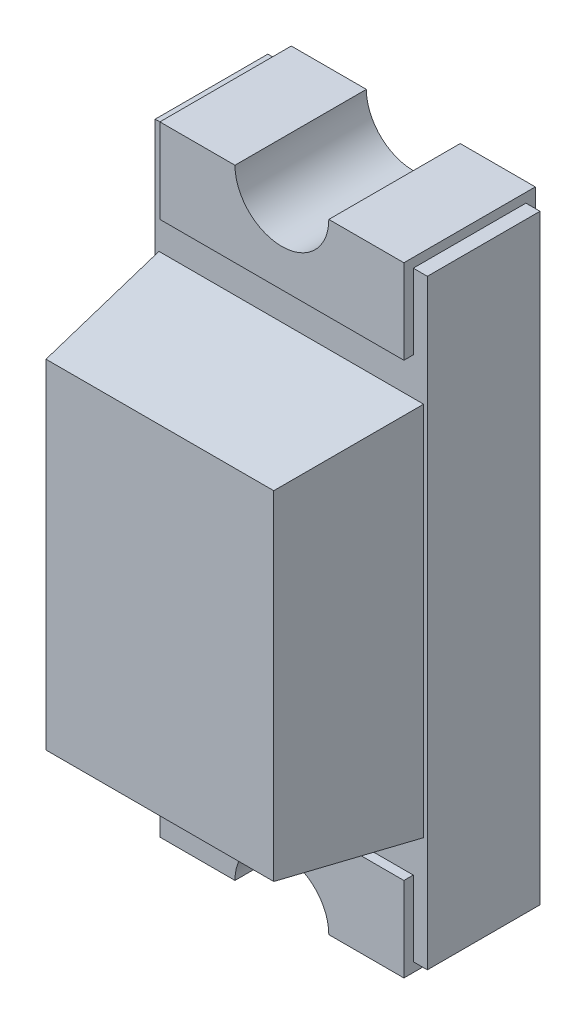
ISO-10303-21;
HEADER;
FILE_DESCRIPTION(('STEP AP214'),'2;1');
FILE_NAME('part.step','',(''),(''),'','','');
FILE_SCHEMA(('AUTOMOTIVE_DESIGN { 1 0 10303 214 1 1 1 1 }'));
ENDSEC;
DATA;
#1=APPLICATION_CONTEXT('core data for automotive mechanical design processes');
#2=APPLICATION_PROTOCOL_DEFINITION('international standard','automotive_design',2000,#1);
#3=PRODUCT_CONTEXT('',#1,'mechanical');
#4=PRODUCT('Part','Part','',(#3));
#5=PRODUCT_RELATED_PRODUCT_CATEGORY('part','',(#4));
#6=PRODUCT_DEFINITION_FORMATION('','',#4);
#7=PRODUCT_DEFINITION_CONTEXT('part definition',#1,'design');
#8=PRODUCT_DEFINITION('design','',#6,#7);
#9=PRODUCT_DEFINITION_SHAPE('','',#8);
#10=(LENGTH_UNIT() NAMED_UNIT(*) SI_UNIT(.MILLI.,.METRE.));
#11=(NAMED_UNIT(*) PLANE_ANGLE_UNIT() SI_UNIT($,.RADIAN.));
#12=(NAMED_UNIT(*) SI_UNIT($,.STERADIAN.) SOLID_ANGLE_UNIT());
#13=UNCERTAINTY_MEASURE_WITH_UNIT(LENGTH_MEASURE(1.E-05),#10,'distance_accuracy_value','');
#14=(GEOMETRIC_REPRESENTATION_CONTEXT(3) GLOBAL_UNCERTAINTY_ASSIGNED_CONTEXT((#13)) GLOBAL_UNIT_ASSIGNED_CONTEXT((#10,
#11,#12)) REPRESENTATION_CONTEXT('',''));
#15=CARTESIAN_POINT('',(0.,0.,0.));
#16=DIRECTION('',(0.,0.,1.));
#17=DIRECTION('',(1.,0.,0.));
#18=AXIS2_PLACEMENT_3D('',#15,#16,#17);
#19=CARTESIAN_POINT('',(1.19861374280474,-1.4174415900558,0.325));
#20=DIRECTION('',(0.,0.,1.));
#21=DIRECTION('',(1.,0.,0.));
#22=AXIS2_PLACEMENT_3D('',#19,#20,#21);
#23=PLANE('',#22);
#24=DIRECTION('',(1.,0.,0.));
#25=VECTOR('',#24,1.);
#26=CARTESIAN_POINT('',(0.836113742804736,-1.4174415900558,0.325));
#27=LINE('',#26,#25);
#28=CARTESIAN_POINT('',(0.836113742804736,-1.4174415900558,0.325));
#29=VERTEX_POINT('',#28);
#30=CARTESIAN_POINT('',(0.873613742804736,-1.4174415900558,0.325));
#31=VERTEX_POINT('',#30);
#32=EDGE_CURVE('E320',#29,#31,#27,.T.);
#33=ORIENTED_EDGE('',*,*,#32,.T.);
#34=DIRECTION('',(0.,1.,0.));
#35=VECTOR('',#34,1.);
#36=CARTESIAN_POINT('',(0.873613742804736,-1.4174415900558,0.325));
#37=LINE('',#36,#35);
#38=CARTESIAN_POINT('',(0.873613742804736,-1.2174415900558,0.325));
#39=VERTEX_POINT('',#38);
#40=EDGE_CURVE('E313',#31,#39,#37,.T.);
#41=ORIENTED_EDGE('',*,*,#40,.T.);
#42=DIRECTION('',(1.,0.,0.));
#43=VECTOR('',#42,1.);
#44=CARTESIAN_POINT('',(1.19861374280474,-1.2174415900558,0.325));
#45=LINE('',#44,#43);
#46=CARTESIAN_POINT('',(1.52361374280474,-1.2174415900558,0.325));
#47=VERTEX_POINT('',#46);
#48=EDGE_CURVE('E55',#39,#47,#45,.T.);
#49=ORIENTED_EDGE('',*,*,#48,.T.);
#50=DIRECTION('',(0.,-1.,0.));
#51=VECTOR('',#50,1.);
#52=CARTESIAN_POINT('',(1.52361374280474,-1.4174415900558,0.325));
#53=LINE('',#52,#51);
#54=CARTESIAN_POINT('',(1.52361374280474,-1.4174415900558,0.325));
#55=VERTEX_POINT('',#54);
#56=EDGE_CURVE('E308',#47,#55,#53,.T.);
#57=ORIENTED_EDGE('',*,*,#56,.T.);
#58=DIRECTION('',(1.,0.,0.));
#59=VECTOR('',#58,1.);
#60=CARTESIAN_POINT('',(1.37361374280474,-1.4174415900558,0.325));
#61=LINE('',#60,#59);
#62=CARTESIAN_POINT('',(1.56111374280474,-1.4174415900558,0.325));
#63=VERTEX_POINT('',#62);
#64=EDGE_CURVE('E324',#55,#63,#61,.T.);
#65=ORIENTED_EDGE('',*,*,#64,.T.);
#66=DIRECTION('',(0.,1.,0.));
#67=VECTOR('',#66,1.);
#68=CARTESIAN_POINT('',(1.56111374280474,0.182558409944199,0.325));
#69=LINE('',#68,#67);
#70=CARTESIAN_POINT('',(1.56111374280474,0.182558409944199,0.325));
#71=VERTEX_POINT('',#70);
#72=EDGE_CURVE('E326',#63,#71,#69,.T.);
#73=ORIENTED_EDGE('',*,*,#72,.T.);
#74=DIRECTION('',(-1.,0.,0.));
#75=VECTOR('',#74,1.);
#76=CARTESIAN_POINT('',(1.37361374280474,0.182558409944199,0.325));
#77=LINE('',#76,#75);
#78=CARTESIAN_POINT('',(1.52361374280474,0.182558409944199,0.325));
#79=VERTEX_POINT('',#78);
#80=EDGE_CURVE('E328',#71,#79,#77,.T.);
#81=ORIENTED_EDGE('',*,*,#80,.T.);
#82=DIRECTION('',(0.,1.,0.));
#83=VECTOR('',#82,1.);
#84=CARTESIAN_POINT('',(1.52361374280474,0.207558409944199,0.325));
#85=LINE('',#84,#83);
#86=CARTESIAN_POINT('',(1.52361374280474,-0.0174415900558012,0.325));
#87=VERTEX_POINT('',#86);
#88=EDGE_CURVE('E421',#87,#79,#85,.T.);
#89=ORIENTED_EDGE('',*,*,#88,.F.);
#90=DIRECTION('',(1.,0.,0.));
#91=VECTOR('',#90,1.);
#92=CARTESIAN_POINT('',(0.873613742804736,-0.0174415900558012,0.325));
#93=LINE('',#92,#91);
#94=CARTESIAN_POINT('',(0.873613742804736,-0.0174415900558012,0.325));
#95=VERTEX_POINT('',#94);
#96=EDGE_CURVE('E364',#95,#87,#93,.T.);
#97=ORIENTED_EDGE('',*,*,#96,.F.);
#98=DIRECTION('',(0.,-1.,0.));
#99=VECTOR('',#98,1.);
#100=CARTESIAN_POINT('',(0.873613742804736,0.207558409944199,0.325));
#101=LINE('',#100,#99);
#102=CARTESIAN_POINT('',(0.873613742804736,0.182558409944199,0.325));
#103=VERTEX_POINT('',#102);
#104=EDGE_CURVE('E366',#103,#95,#101,.T.);
#105=ORIENTED_EDGE('',*,*,#104,.F.);
#106=DIRECTION('',(-1.,0.,0.));
#107=VECTOR('',#106,1.);
#108=CARTESIAN_POINT('',(0.836113742804736,0.182558409944199,0.325));
#109=LINE('',#108,#107);
#110=CARTESIAN_POINT('',(0.836113742804736,0.182558409944199,0.325));
#111=VERTEX_POINT('',#110);
#112=EDGE_CURVE('E331',#103,#111,#109,.T.);
#113=ORIENTED_EDGE('',*,*,#112,.T.);
#114=DIRECTION('',(0.,-1.,0.));
#115=VECTOR('',#114,1.);
#116=CARTESIAN_POINT('',(0.836113742804736,0.182558409944199,0.325));
#117=LINE('',#116,#115);
#118=EDGE_CURVE('E317',#111,#29,#117,.T.);
#119=ORIENTED_EDGE('',*,*,#118,.T.);
#120=EDGE_LOOP('',(#33,#41,#49,#57,#65,#73,#81,#89,#97,#105,#113,#119));
#121=FACE_BOUND('',#120,.T.);
#122=DIRECTION('',(1.,0.,0.));
#123=VECTOR('',#122,1.);
#124=CARTESIAN_POINT('',(0.846113742804736,-1.1174415900558,0.325));
#125=LINE('',#124,#123);
#126=CARTESIAN_POINT('',(0.846113742804736,-1.1174415900558,0.325));
#127=VERTEX_POINT('',#126);
#128=CARTESIAN_POINT('',(1.55111374280474,-1.1174415900558,0.325));
#129=VERTEX_POINT('',#128);
#130=EDGE_CURVE('E223',#127,#129,#125,.T.);
#131=ORIENTED_EDGE('',*,*,#130,.F.);
#132=DIRECTION('',(0.,-1.,0.));
#133=VECTOR('',#132,1.);
#134=CARTESIAN_POINT('',(0.846113742804735,-0.117441590055801,0.325));
#135=LINE('',#134,#133);
#136=CARTESIAN_POINT('',(0.846113742804735,-0.117441590055801,0.325));
#137=VERTEX_POINT('',#136);
#138=EDGE_CURVE('E234',#137,#127,#135,.T.);
#139=ORIENTED_EDGE('',*,*,#138,.F.);
#140=DIRECTION('',(-1.,0.,0.));
#141=VECTOR('',#140,1.);
#142=CARTESIAN_POINT('',(0.846113742804735,-0.117441590055801,0.325));
#143=LINE('',#142,#141);
#144=CARTESIAN_POINT('',(1.55111374280474,-0.117441590055801,0.325));
#145=VERTEX_POINT('',#144);
#146=EDGE_CURVE('E244',#145,#137,#143,.T.);
#147=ORIENTED_EDGE('',*,*,#146,.F.);
#148=DIRECTION('',(0.,1.,0.));
#149=VECTOR('',#148,1.);
#150=CARTESIAN_POINT('',(1.55111374280474,-0.117441590055801,0.325));
#151=LINE('',#150,#149);
#152=EDGE_CURVE('E242',#129,#145,#151,.T.);
#153=ORIENTED_EDGE('',*,*,#152,.F.);
#154=EDGE_LOOP('',(#131,#139,#147,#153));
#155=FACE_BOUND('',#154,.T.);
#156=ADVANCED_FACE('F32',(#121,#155),#23,.T.);
#157=CARTESIAN_POINT('',(1.19861374280474,-1.4174415900558,0.025));
#158=DIRECTION('',(0.,0.,1.));
#159=DIRECTION('',(1.,0.,0.));
#160=AXIS2_PLACEMENT_3D('',#157,#158,#159);
#161=PLANE('',#160);
#162=DIRECTION('',(0.,1.,0.));
#163=VECTOR('',#162,1.);
#164=CARTESIAN_POINT('',(0.873613742804736,-1.4174415900558,0.025));
#165=LINE('',#164,#163);
#166=CARTESIAN_POINT('',(0.873613742804736,-1.4174415900558,0.025));
#167=VERTEX_POINT('',#166);
#168=CARTESIAN_POINT('',(0.873613742804736,-1.2174415900558,0.025));
#169=VERTEX_POINT('',#168);
#170=EDGE_CURVE('E310',#167,#169,#165,.T.);
#171=ORIENTED_EDGE('',*,*,#170,.F.);
#172=DIRECTION('',(1.,0.,0.));
#173=VECTOR('',#172,1.);
#174=CARTESIAN_POINT('',(0.836113742804736,-1.4174415900558,0.025));
#175=LINE('',#174,#173);
#176=CARTESIAN_POINT('',(0.836113742804736,-1.4174415900558,0.025));
#177=VERTEX_POINT('',#176);
#178=EDGE_CURVE('E336',#177,#167,#175,.T.);
#179=ORIENTED_EDGE('',*,*,#178,.F.);
#180=DIRECTION('',(0.,-1.,0.));
#181=VECTOR('',#180,1.);
#182=CARTESIAN_POINT('',(0.836113742804736,0.182558409944199,0.025));
#183=LINE('',#182,#181);
#184=CARTESIAN_POINT('',(0.836113742804736,0.182558409944199,0.025));
#185=VERTEX_POINT('',#184);
#186=EDGE_CURVE('E316',#185,#177,#183,.T.);
#187=ORIENTED_EDGE('',*,*,#186,.F.);
#188=DIRECTION('',(-1.,0.,0.));
#189=VECTOR('',#188,1.);
#190=CARTESIAN_POINT('',(0.836113742804736,0.182558409944199,0.025));
#191=LINE('',#190,#189);
#192=CARTESIAN_POINT('',(0.873613742804736,0.182558409944199,0.025));
#193=VERTEX_POINT('',#192);
#194=EDGE_CURVE('E321',#193,#185,#191,.T.);
#195=ORIENTED_EDGE('',*,*,#194,.F.);
#196=DIRECTION('',(0.,-1.,0.));
#197=VECTOR('',#196,1.);
#198=CARTESIAN_POINT('',(0.873613742804736,0.207558409944199,0.025));
#199=LINE('',#198,#197);
#200=CARTESIAN_POINT('',(0.873613742804736,-0.0174415900558012,0.025));
#201=VERTEX_POINT('',#200);
#202=EDGE_CURVE('E361',#193,#201,#199,.T.);
#203=ORIENTED_EDGE('',*,*,#202,.T.);
#204=DIRECTION('',(1.,0.,0.));
#205=VECTOR('',#204,1.);
#206=CARTESIAN_POINT('',(0.873613742804736,-0.0174415900558012,0.025));
#207=LINE('',#206,#205);
#208=CARTESIAN_POINT('',(1.52361374280474,-0.0174415900558012,0.025));
#209=VERTEX_POINT('',#208);
#210=EDGE_CURVE('E358',#201,#209,#207,.T.);
#211=ORIENTED_EDGE('',*,*,#210,.T.);
#212=DIRECTION('',(0.,1.,0.));
#213=VECTOR('',#212,1.);
#214=CARTESIAN_POINT('',(1.52361374280474,0.207558409944199,0.025));
#215=LINE('',#214,#213);
#216=CARTESIAN_POINT('',(1.52361374280474,0.182558409944199,0.025));
#217=VERTEX_POINT('',#216);
#218=EDGE_CURVE('E415',#209,#217,#215,.T.);
#219=ORIENTED_EDGE('',*,*,#218,.T.);
#220=DIRECTION('',(-1.,0.,0.));
#221=VECTOR('',#220,1.);
#222=CARTESIAN_POINT('',(1.37361374280474,0.182558409944199,0.025));
#223=LINE('',#222,#221);
#224=CARTESIAN_POINT('',(1.56111374280474,0.182558409944199,0.025));
#225=VERTEX_POINT('',#224);
#226=EDGE_CURVE('E343',#225,#217,#223,.T.);
#227=ORIENTED_EDGE('',*,*,#226,.F.);
#228=DIRECTION('',(0.,1.,0.));
#229=VECTOR('',#228,1.);
#230=CARTESIAN_POINT('',(1.56111374280474,0.182558409944199,0.025));
#231=LINE('',#230,#229);
#232=CARTESIAN_POINT('',(1.56111374280474,-1.4174415900558,0.025));
#233=VERTEX_POINT('',#232);
#234=EDGE_CURVE('E341',#233,#225,#231,.T.);
#235=ORIENTED_EDGE('',*,*,#234,.F.);
#236=DIRECTION('',(1.,0.,0.));
#237=VECTOR('',#236,1.);
#238=CARTESIAN_POINT('',(1.37361374280474,-1.4174415900558,0.025));
#239=LINE('',#238,#237);
#240=CARTESIAN_POINT('',(1.52361374280474,-1.4174415900558,0.025));
#241=VERTEX_POINT('',#240);
#242=EDGE_CURVE('E339',#241,#233,#239,.T.);
#243=ORIENTED_EDGE('',*,*,#242,.F.);
#244=DIRECTION('',(0.,-1.,0.));
#245=VECTOR('',#244,1.);
#246=CARTESIAN_POINT('',(1.52361374280474,-1.4174415900558,0.025));
#247=LINE('',#246,#245);
#248=CARTESIAN_POINT('',(1.52361374280474,-1.2174415900558,0.025));
#249=VERTEX_POINT('',#248);
#250=EDGE_CURVE('E305',#249,#241,#247,.T.);
#251=ORIENTED_EDGE('',*,*,#250,.F.);
#252=DIRECTION('',(1.,0.,0.));
#253=VECTOR('',#252,1.);
#254=CARTESIAN_POINT('',(1.19861374280474,-1.2174415900558,0.025));
#255=LINE('',#254,#253);
#256=EDGE_CURVE('E11',#169,#249,#255,.T.);
#257=ORIENTED_EDGE('',*,*,#256,.F.);
#258=EDGE_LOOP('',(#171,#179,#187,#195,#203,#211,#219,#227,#235,#243,#251,#257));
#259=FACE_BOUND('',#258,.T.);
#260=ADVANCED_FACE('F445',(#259),#161,.F.);
#261=CARTESIAN_POINT('',(0.836113742804736,-1.4174415900558,0.325));
#262=DIRECTION('',(0.,1.,0.));
#263=DIRECTION('',(0.,0.,1.));
#264=AXIS2_PLACEMENT_3D('',#261,#262,#263);
#265=PLANE('',#264);
#266=DIRECTION('',(0.,0.,-1.));
#267=VECTOR('',#266,1.);
#268=CARTESIAN_POINT('',(0.873613742804736,-1.4174415900558,0.325));
#269=LINE('',#268,#267);
#270=EDGE_CURVE('E40',#31,#167,#269,.T.);
#271=ORIENTED_EDGE('',*,*,#270,.F.);
#272=ORIENTED_EDGE('',*,*,#32,.F.);
#273=DIRECTION('',(0.,0.,-1.));
#274=VECTOR('',#273,1.);
#275=CARTESIAN_POINT('',(0.836113742804736,-1.4174415900558,0.325));
#276=LINE('',#275,#274);
#277=EDGE_CURVE('E355',#29,#177,#276,.T.);
#278=ORIENTED_EDGE('',*,*,#277,.T.);
#279=ORIENTED_EDGE('',*,*,#178,.T.);
#280=EDGE_LOOP('',(#271,#272,#278,#279));
#281=FACE_BOUND('',#280,.T.);
#282=ADVANCED_FACE('F434',(#281),#265,.F.);
#283=CARTESIAN_POINT('',(1.37361374280474,-1.4174415900558,0.325));
#284=DIRECTION('',(0.,1.,0.));
#285=DIRECTION('',(0.,0.,1.));
#286=AXIS2_PLACEMENT_3D('',#283,#284,#285);
#287=PLANE('',#286);
#288=DIRECTION('',(0.,0.,1.));
#289=VECTOR('',#288,1.);
#290=CARTESIAN_POINT('',(1.52361374280474,-1.4174415900558,0.325));
#291=LINE('',#290,#289);
#292=EDGE_CURVE('E426',#241,#55,#291,.T.);
#293=ORIENTED_EDGE('',*,*,#292,.F.);
#294=ORIENTED_EDGE('',*,*,#242,.T.);
#295=DIRECTION('',(0.,0.,-1.));
#296=VECTOR('',#295,1.);
#297=CARTESIAN_POINT('',(1.56111374280474,-1.4174415900558,0.325));
#298=LINE('',#297,#296);
#299=EDGE_CURVE('E352',#63,#233,#298,.T.);
#300=ORIENTED_EDGE('',*,*,#299,.F.);
#301=ORIENTED_EDGE('',*,*,#64,.F.);
#302=EDGE_LOOP('',(#293,#294,#300,#301));
#303=FACE_BOUND('',#302,.T.);
#304=ADVANCED_FACE('F478',(#303),#287,.F.);
#305=CARTESIAN_POINT('',(0.873613742804736,-0.0174415900558012,0.35));
#306=DIRECTION('',(0.,1.,0.));
#307=DIRECTION('',(0.,0.,1.));
#308=AXIS2_PLACEMENT_3D('',#305,#306,#307);
#309=PLANE('',#308);
#310=ORIENTED_EDGE('',*,*,#210,.F.);
#311=DIRECTION('',(0.,0.,-1.));
#312=VECTOR('',#311,1.);
#313=CARTESIAN_POINT('',(0.873613742804736,-0.0174415900558012,0.35));
#314=LINE('',#313,#312);
#315=CARTESIAN_POINT('',(0.873613742804736,-0.0174415900558012,0.));
#316=VERTEX_POINT('',#315);
#317=EDGE_CURVE('E411',#201,#316,#314,.T.);
#318=ORIENTED_EDGE('',*,*,#317,.T.);
#319=DIRECTION('',(1.,0.,0.));
#320=VECTOR('',#319,1.);
#321=CARTESIAN_POINT('',(0.873613742804736,-0.0174415900558012,0.));
#322=LINE('',#321,#320);
#323=CARTESIAN_POINT('',(1.52361374280474,-0.0174415900558012,0.));
#324=VERTEX_POINT('',#323);
#325=EDGE_CURVE('E386',#316,#324,#322,.T.);
#326=ORIENTED_EDGE('',*,*,#325,.T.);
#327=DIRECTION('',(0.,0.,-1.));
#328=VECTOR('',#327,1.);
#329=CARTESIAN_POINT('',(1.52361374280474,-0.0174415900558012,0.35));
#330=LINE('',#329,#328);
#331=EDGE_CURVE('E407',#209,#324,#330,.T.);
#332=ORIENTED_EDGE('',*,*,#331,.F.);
#333=EDGE_LOOP('',(#310,#318,#326,#332));
#334=FACE_BOUND('',#333,.T.);
#335=ADVANCED_FACE('F649',(#334),#309,.F.);
#336=CARTESIAN_POINT('',(0.873613742804736,0.207558409944199,0.35));
#337=DIRECTION('',(1.,0.,0.));
#338=DIRECTION('',(0.,0.,-1.));
#339=AXIS2_PLACEMENT_3D('',#336,#337,#338);
#340=PLANE('',#339);
#341=DIRECTION('',(0.,0.,-1.));
#342=VECTOR('',#341,1.);
#343=CARTESIAN_POINT('',(0.873613742804736,0.182558409944199,0.35));
#344=LINE('',#343,#342);
#345=EDGE_CURVE('E423',#103,#193,#344,.T.);
#346=ORIENTED_EDGE('',*,*,#345,.F.);
#347=ORIENTED_EDGE('',*,*,#104,.T.);
#348=CARTESIAN_POINT('',(0.873613742804736,-0.0174415900558012,0.35));
#349=VERTEX_POINT('',#348);
#350=EDGE_CURVE('E412',#349,#95,#314,.T.);
#351=ORIENTED_EDGE('',*,*,#350,.F.);
#352=DIRECTION('',(0.,-1.,0.));
#353=VECTOR('',#352,1.);
#354=CARTESIAN_POINT('',(0.873613742804736,0.207558409944199,0.35));
#355=LINE('',#354,#353);
#356=CARTESIAN_POINT('',(0.873613742804736,0.207558409944199,0.35));
#357=VERTEX_POINT('',#356);
#358=EDGE_CURVE('E369',#357,#349,#355,.T.);
#359=ORIENTED_EDGE('',*,*,#358,.F.);
#360=DIRECTION('',(0.,0.,-1.));
#361=VECTOR('',#360,1.);
#362=CARTESIAN_POINT('',(0.873613742804736,0.207558409944199,0.35));
#363=LINE('',#362,#361);
#364=CARTESIAN_POINT('',(0.873613742804736,0.207558409944199,0.));
#365=VERTEX_POINT('',#364);
#366=EDGE_CURVE('E383',#357,#365,#363,.T.);
#367=ORIENTED_EDGE('',*,*,#366,.T.);
#368=DIRECTION('',(0.,-1.,0.));
#369=VECTOR('',#368,1.);
#370=CARTESIAN_POINT('',(0.873613742804736,0.207558409944199,0.));
#371=LINE('',#370,#369);
#372=EDGE_CURVE('E368',#365,#316,#371,.T.);
#373=ORIENTED_EDGE('',*,*,#372,.T.);
#374=ORIENTED_EDGE('',*,*,#317,.F.);
#375=ORIENTED_EDGE('',*,*,#202,.F.);
#376=EDGE_LOOP('',(#346,#347,#351,#359,#367,#373,#374,#375));
#377=FACE_BOUND('',#376,.T.);
#378=ADVANCED_FACE('F34',(#377),#340,.F.);
#379=ORIENTED_EDGE('',*,*,#350,.T.);
#380=ORIENTED_EDGE('',*,*,#96,.T.);
#381=CARTESIAN_POINT('',(1.52361374280474,-0.0174415900558012,0.35));
#382=VERTEX_POINT('',#381);
#383=EDGE_CURVE('E408',#382,#87,#330,.T.);
#384=ORIENTED_EDGE('',*,*,#383,.F.);
#385=DIRECTION('',(1.,0.,0.));
#386=VECTOR('',#385,1.);
#387=CARTESIAN_POINT('',(0.873613742804736,-0.0174415900558012,0.35));
#388=LINE('',#387,#386);
#389=EDGE_CURVE('E372',#349,#382,#388,.T.);
#390=ORIENTED_EDGE('',*,*,#389,.F.);
#391=EDGE_LOOP('',(#379,#380,#384,#390));
#392=FACE_BOUND('',#391,.T.);
#393=ADVANCED_FACE('F494',(#392),#309,.F.);
#394=CARTESIAN_POINT('',(1.52361374280474,0.207558409944199,0.35));
#395=DIRECTION('',(-1.,0.,0.));
#396=DIRECTION('',(0.,0.,1.));
#397=AXIS2_PLACEMENT_3D('',#394,#395,#396);
#398=PLANE('',#397);
#399=ORIENTED_EDGE('',*,*,#383,.T.);
#400=ORIENTED_EDGE('',*,*,#88,.T.);
#401=DIRECTION('',(0.,0.,1.));
#402=VECTOR('',#401,1.);
#403=CARTESIAN_POINT('',(1.52361374280474,0.182558409944199,0.35));
#404=LINE('',#403,#402);
#405=EDGE_CURVE('E418',#217,#79,#404,.T.);
#406=ORIENTED_EDGE('',*,*,#405,.F.);
#407=ORIENTED_EDGE('',*,*,#218,.F.);
#408=ORIENTED_EDGE('',*,*,#331,.T.);
#409=DIRECTION('',(0.,1.,0.));
#410=VECTOR('',#409,1.);
#411=CARTESIAN_POINT('',(1.52361374280474,0.207558409944199,0.));
#412=LINE('',#411,#410);
#413=CARTESIAN_POINT('',(1.52361374280474,0.207558409944199,0.));
#414=VERTEX_POINT('',#413);
#415=EDGE_CURVE('E389',#324,#414,#412,.T.);
#416=ORIENTED_EDGE('',*,*,#415,.T.);
#417=DIRECTION('',(0.,0.,-1.));
#418=VECTOR('',#417,1.);
#419=CARTESIAN_POINT('',(1.52361374280474,0.207558409944199,0.35));
#420=LINE('',#419,#418);
#421=CARTESIAN_POINT('',(1.52361374280474,0.207558409944199,0.35));
#422=VERTEX_POINT('',#421);
#423=EDGE_CURVE('E404',#422,#414,#420,.T.);
#424=ORIENTED_EDGE('',*,*,#423,.F.);
#425=DIRECTION('',(0.,1.,0.));
#426=VECTOR('',#425,1.);
#427=CARTESIAN_POINT('',(1.52361374280474,0.207558409944199,0.35));
#428=LINE('',#427,#426);
#429=EDGE_CURVE('E375',#382,#422,#428,.T.);
#430=ORIENTED_EDGE('',*,*,#429,.F.);
#431=EDGE_LOOP('',(#399,#400,#406,#407,#408,#416,#424,#430));
#432=FACE_BOUND('',#431,.T.);
#433=ADVANCED_FACE('F489',(#432),#398,.F.);
#434=CARTESIAN_POINT('',(1.32361374280474,0.207558409944199,0.35));
#435=DIRECTION('',(0.,-1.,0.));
#436=DIRECTION('',(0.,0.,-1.));
#437=AXIS2_PLACEMENT_3D('',#434,#435,#436);
#438=PLANE('',#437);
#439=DIRECTION('',(-1.,0.,0.));
#440=VECTOR('',#439,1.);
#441=CARTESIAN_POINT('',(1.32361374280474,0.207558409944199,0.));
#442=LINE('',#441,#440);
#443=CARTESIAN_POINT('',(1.32361374280474,0.207558409944199,0.));
#444=VERTEX_POINT('',#443);
#445=EDGE_CURVE('E391',#414,#444,#442,.T.);
#446=ORIENTED_EDGE('',*,*,#445,.T.);
#447=DIRECTION('',(0.,0.,-1.));
#448=VECTOR('',#447,1.);
#449=CARTESIAN_POINT('',(1.32361374280474,0.207558409944199,0.35));
#450=LINE('',#449,#448);
#451=CARTESIAN_POINT('',(1.32361374280474,0.207558409944199,0.35));
#452=VERTEX_POINT('',#451);
#453=EDGE_CURVE('E401',#452,#444,#450,.T.);
#454=ORIENTED_EDGE('',*,*,#453,.F.);
#455=DIRECTION('',(-1.,0.,0.));
#456=VECTOR('',#455,1.);
#457=CARTESIAN_POINT('',(1.32361374280474,0.207558409944199,0.35));
#458=LINE('',#457,#456);
#459=EDGE_CURVE('E377',#422,#452,#458,.T.);
#460=ORIENTED_EDGE('',*,*,#459,.F.);
#461=ORIENTED_EDGE('',*,*,#423,.T.);
#462=EDGE_LOOP('',(#446,#454,#460,#461));
#463=FACE_BOUND('',#462,.T.);
#464=ADVANCED_FACE('F638',(#463),#438,.F.);
#465=CARTESIAN_POINT('',(1.19861374280474,0.207558409944199,0.35));
#466=DIRECTION('',(0.,0.,-1.));
#467=DIRECTION('',(-1.,0.,0.));
#468=AXIS2_PLACEMENT_3D('',#465,#466,#467);
#469=CYLINDRICAL_SURFACE('',#468,0.125);
#470=CARTESIAN_POINT('',(1.19861374280474,0.207558409944199,0.));
#471=DIRECTION('',(0.,0.,-1.));
#472=DIRECTION('',(1.,0.,0.));
#473=AXIS2_PLACEMENT_3D('',#470,#471,#472);
#474=CIRCLE('',#473,0.125);
#475=CARTESIAN_POINT('',(1.07361374280474,0.207558409944199,0.));
#476=VERTEX_POINT('',#475);
#477=EDGE_CURVE('E393',#444,#476,#474,.T.);
#478=ORIENTED_EDGE('',*,*,#477,.T.);
#479=DIRECTION('',(0.,0.,-1.));
#480=VECTOR('',#479,1.);
#481=CARTESIAN_POINT('',(1.07361374280474,0.207558409944199,0.35));
#482=LINE('',#481,#480);
#483=CARTESIAN_POINT('',(1.07361374280474,0.207558409944199,0.35));
#484=VERTEX_POINT('',#483);
#485=EDGE_CURVE('E398',#484,#476,#482,.T.);
#486=ORIENTED_EDGE('',*,*,#485,.F.);
#487=CARTESIAN_POINT('',(1.19861374280474,0.207558409944199,0.35));
#488=DIRECTION('',(0.,0.,-1.));
#489=DIRECTION('',(1.,0.,0.));
#490=AXIS2_PLACEMENT_3D('',#487,#488,#489);
#491=CIRCLE('',#490,0.125);
#492=EDGE_CURVE('E379',#452,#484,#491,.T.);
#493=ORIENTED_EDGE('',*,*,#492,.F.);
#494=ORIENTED_EDGE('',*,*,#453,.T.);
#495=EDGE_LOOP('',(#478,#486,#493,#494));
#496=FACE_BOUND('',#495,.T.);
#497=ADVANCED_FACE('F709',(#496),#469,.F.);
#498=CARTESIAN_POINT('',(0.873613742804736,0.207558409944199,0.35));
#499=DIRECTION('',(0.,-1.,0.));
#500=DIRECTION('',(0.,0.,-1.));
#501=AXIS2_PLACEMENT_3D('',#498,#499,#500);
#502=PLANE('',#501);
#503=DIRECTION('',(-1.,0.,0.));
#504=VECTOR('',#503,1.);
#505=CARTESIAN_POINT('',(0.873613742804736,0.207558409944199,0.));
#506=LINE('',#505,#504);
#507=EDGE_CURVE('E373',#476,#365,#506,.T.);
#508=ORIENTED_EDGE('',*,*,#507,.T.);
#509=ORIENTED_EDGE('',*,*,#366,.F.);
#510=DIRECTION('',(-1.,0.,0.));
#511=VECTOR('',#510,1.);
#512=CARTESIAN_POINT('',(0.873613742804736,0.207558409944199,0.35));
#513=LINE('',#512,#511);
#514=EDGE_CURVE('E381',#484,#357,#513,.T.);
#515=ORIENTED_EDGE('',*,*,#514,.F.);
#516=ORIENTED_EDGE('',*,*,#485,.T.);
#517=EDGE_LOOP('',(#508,#509,#515,#516));
#518=FACE_BOUND('',#517,.T.);
#519=ADVANCED_FACE('F699',(#518),#502,.F.);
#520=CARTESIAN_POINT('',(1.19861374280474,0.207558409944199,0.35));
#521=DIRECTION('',(0.,0.,1.));
#522=DIRECTION('',(1.,0.,0.));
#523=AXIS2_PLACEMENT_3D('',#520,#521,#522);
#524=PLANE('',#523);
#525=ORIENTED_EDGE('',*,*,#358,.T.);
#526=ORIENTED_EDGE('',*,*,#389,.T.);
#527=ORIENTED_EDGE('',*,*,#429,.T.);
#528=ORIENTED_EDGE('',*,*,#459,.T.);
#529=ORIENTED_EDGE('',*,*,#492,.T.);
#530=ORIENTED_EDGE('',*,*,#514,.T.);
#531=EDGE_LOOP('',(#525,#526,#527,#528,#529,#530));
#532=FACE_BOUND('',#531,.T.);
#533=ADVANCED_FACE('F508',(#532),#524,.T.);
#534=CARTESIAN_POINT('',(1.19861374280474,0.207558409944199,0.));
#535=DIRECTION('',(0.,0.,1.));
#536=DIRECTION('',(1.,0.,0.));
#537=AXIS2_PLACEMENT_3D('',#534,#535,#536);
#538=PLANE('',#537);
#539=ORIENTED_EDGE('',*,*,#372,.F.);
#540=ORIENTED_EDGE('',*,*,#507,.F.);
#541=ORIENTED_EDGE('',*,*,#477,.F.);
#542=ORIENTED_EDGE('',*,*,#445,.F.);
#543=ORIENTED_EDGE('',*,*,#415,.F.);
#544=ORIENTED_EDGE('',*,*,#325,.F.);
#545=EDGE_LOOP('',(#539,#540,#541,#542,#543,#544));
#546=FACE_BOUND('',#545,.T.);
#547=ADVANCED_FACE('F501',(#546),#538,.F.);
#548=CARTESIAN_POINT('',(0.836113742804736,0.182558409944199,0.325));
#549=DIRECTION('',(0.,-1.,0.));
#550=DIRECTION('',(0.,0.,-1.));
#551=AXIS2_PLACEMENT_3D('',#548,#549,#550);
#552=PLANE('',#551);
#553=ORIENTED_EDGE('',*,*,#112,.F.);
#554=ORIENTED_EDGE('',*,*,#345,.T.);
#555=ORIENTED_EDGE('',*,*,#194,.T.);
#556=DIRECTION('',(0.,0.,-1.));
#557=VECTOR('',#556,1.);
#558=CARTESIAN_POINT('',(0.836113742804736,0.182558409944199,0.325));
#559=LINE('',#558,#557);
#560=EDGE_CURVE('E333',#111,#185,#559,.T.);
#561=ORIENTED_EDGE('',*,*,#560,.F.);
#562=EDGE_LOOP('',(#553,#554,#555,#561));
#563=FACE_BOUND('',#562,.T.);
#564=ADVANCED_FACE('F499',(#563),#552,.F.);
#565=CARTESIAN_POINT('',(1.37361374280474,0.182558409944199,0.325));
#566=DIRECTION('',(0.,-1.,0.));
#567=DIRECTION('',(1.,0.,0.));
#568=AXIS2_PLACEMENT_3D('',#565,#566,#567);
#569=PLANE('',#568);
#570=ORIENTED_EDGE('',*,*,#226,.T.);
#571=ORIENTED_EDGE('',*,*,#405,.T.);
#572=ORIENTED_EDGE('',*,*,#80,.F.);
#573=DIRECTION('',(0.,0.,-1.));
#574=VECTOR('',#573,1.);
#575=CARTESIAN_POINT('',(1.56111374280474,0.182558409944199,0.325));
#576=LINE('',#575,#574);
#577=EDGE_CURVE('E349',#71,#225,#576,.T.);
#578=ORIENTED_EDGE('',*,*,#577,.T.);
#579=EDGE_LOOP('',(#570,#571,#572,#578));
#580=FACE_BOUND('',#579,.T.);
#581=ADVANCED_FACE('F485',(#580),#569,.F.);
#582=CARTESIAN_POINT('',(0.836113742804736,0.182558409944199,0.325));
#583=DIRECTION('',(1.,0.,0.));
#584=DIRECTION('',(0.,1.,0.));
#585=AXIS2_PLACEMENT_3D('',#582,#583,#584);
#586=PLANE('',#585);
#587=ORIENTED_EDGE('',*,*,#186,.T.);
#588=ORIENTED_EDGE('',*,*,#277,.F.);
#589=ORIENTED_EDGE('',*,*,#118,.F.);
#590=ORIENTED_EDGE('',*,*,#560,.T.);
#591=EDGE_LOOP('',(#587,#588,#589,#590));
#592=FACE_BOUND('',#591,.T.);
#593=ADVANCED_FACE('F441',(#592),#586,.F.);
#594=CARTESIAN_POINT('',(1.56111374280474,0.182558409944199,0.325));
#595=DIRECTION('',(-1.,0.,0.));
#596=DIRECTION('',(0.,0.,1.));
#597=AXIS2_PLACEMENT_3D('',#594,#595,#596);
#598=PLANE('',#597);
#599=ORIENTED_EDGE('',*,*,#234,.T.);
#600=ORIENTED_EDGE('',*,*,#577,.F.);
#601=ORIENTED_EDGE('',*,*,#72,.F.);
#602=ORIENTED_EDGE('',*,*,#299,.T.);
#603=EDGE_LOOP('',(#599,#600,#601,#602));
#604=FACE_BOUND('',#603,.T.);
#605=ADVANCED_FACE('F481',(#604),#598,.F.);
#606=CARTESIAN_POINT('',(0.873613742804736,-1.2174415900558,0.35));
#607=DIRECTION('',(0.,-1.,0.));
#608=DIRECTION('',(0.,0.,-1.));
#609=AXIS2_PLACEMENT_3D('',#606,#607,#608);
#610=PLANE('',#609);
#611=DIRECTION('',(0.,0.,-1.));
#612=VECTOR('',#611,1.);
#613=CARTESIAN_POINT('',(0.873613742804736,-1.2174415900558,0.35));
#614=LINE('',#613,#612);
#615=CARTESIAN_POINT('',(0.873613742804736,-1.2174415900558,0.));
#616=VERTEX_POINT('',#615);
#617=EDGE_CURVE('E272',#169,#616,#614,.T.);
#618=ORIENTED_EDGE('',*,*,#617,.F.);
#619=ORIENTED_EDGE('',*,*,#256,.T.);
#620=DIRECTION('',(0.,0.,-1.));
#621=VECTOR('',#620,1.);
#622=CARTESIAN_POINT('',(1.52361374280474,-1.2174415900558,0.35));
#623=LINE('',#622,#621);
#624=CARTESIAN_POINT('',(1.52361374280474,-1.2174415900558,0.));
#625=VERTEX_POINT('',#624);
#626=EDGE_CURVE('E289',#249,#625,#623,.T.);
#627=ORIENTED_EDGE('',*,*,#626,.T.);
#628=DIRECTION('',(-1.,0.,0.));
#629=VECTOR('',#628,1.);
#630=CARTESIAN_POINT('',(0.873613742804736,-1.2174415900558,0.));
#631=LINE('',#630,#629);
#632=EDGE_CURVE('E262',#625,#616,#631,.T.);
#633=ORIENTED_EDGE('',*,*,#632,.T.);
#634=EDGE_LOOP('',(#618,#619,#627,#633));
#635=FACE_BOUND('',#634,.T.);
#636=ADVANCED_FACE('F449',(#635),#610,.F.);
#637=CARTESIAN_POINT('',(0.873613742804736,-1.2174415900558,0.35));
#638=DIRECTION('',(1.,0.,0.));
#639=DIRECTION('',(0.,0.,-1.));
#640=AXIS2_PLACEMENT_3D('',#637,#638,#639);
#641=PLANE('',#640);
#642=ORIENTED_EDGE('',*,*,#40,.F.);
#643=ORIENTED_EDGE('',*,*,#270,.T.);
#644=ORIENTED_EDGE('',*,*,#170,.T.);
#645=ORIENTED_EDGE('',*,*,#617,.T.);
#646=DIRECTION('',(0.,-1.,0.));
#647=VECTOR('',#646,1.);
#648=CARTESIAN_POINT('',(0.873613742804736,-1.2174415900558,0.));
#649=LINE('',#648,#647);
#650=CARTESIAN_POINT('',(0.873613742804736,-1.4424415900558,0.));
#651=VERTEX_POINT('',#650);
#652=EDGE_CURVE('E229',#616,#651,#649,.T.);
#653=ORIENTED_EDGE('',*,*,#652,.T.);
#654=DIRECTION('',(0.,0.,-1.));
#655=VECTOR('',#654,1.);
#656=CARTESIAN_POINT('',(0.873613742804736,-1.4424415900558,0.35));
#657=LINE('',#656,#655);
#658=CARTESIAN_POINT('',(0.873613742804736,-1.4424415900558,0.35));
#659=VERTEX_POINT('',#658);
#660=EDGE_CURVE('E302',#659,#651,#657,.T.);
#661=ORIENTED_EDGE('',*,*,#660,.F.);
#662=DIRECTION('',(0.,-1.,0.));
#663=VECTOR('',#662,1.);
#664=CARTESIAN_POINT('',(0.873613742804736,-1.2174415900558,0.35));
#665=LINE('',#664,#663);
#666=CARTESIAN_POINT('',(0.873613742804736,-1.2174415900558,0.35));
#667=VERTEX_POINT('',#666);
#668=EDGE_CURVE('E258',#667,#659,#665,.T.);
#669=ORIENTED_EDGE('',*,*,#668,.F.);
#670=EDGE_CURVE('E286',#667,#39,#614,.T.);
#671=ORIENTED_EDGE('',*,*,#670,.T.);
#672=EDGE_LOOP('',(#642,#643,#644,#645,#653,#661,#669,#671));
#673=FACE_BOUND('',#672,.T.);
#674=ADVANCED_FACE('F431',(#673),#641,.F.);
#675=CARTESIAN_POINT('',(0.873613742804736,-1.4424415900558,0.35));
#676=DIRECTION('',(0.,1.,0.));
#677=DIRECTION('',(0.,0.,1.));
#678=AXIS2_PLACEMENT_3D('',#675,#676,#677);
#679=PLANE('',#678);
#680=DIRECTION('',(1.,0.,0.));
#681=VECTOR('',#680,1.);
#682=CARTESIAN_POINT('',(0.873613742804736,-1.4424415900558,0.));
#683=LINE('',#682,#681);
#684=CARTESIAN_POINT('',(1.07361374280474,-1.4424415900558,0.));
#685=VERTEX_POINT('',#684);
#686=EDGE_CURVE('E275',#651,#685,#683,.T.);
#687=ORIENTED_EDGE('',*,*,#686,.T.);
#688=DIRECTION('',(0.,0.,-1.));
#689=VECTOR('',#688,1.);
#690=CARTESIAN_POINT('',(1.07361374280474,-1.4424415900558,0.35));
#691=LINE('',#690,#689);
#692=CARTESIAN_POINT('',(1.07361374280474,-1.4424415900558,0.35));
#693=VERTEX_POINT('',#692);
#694=EDGE_CURVE('E299',#693,#685,#691,.T.);
#695=ORIENTED_EDGE('',*,*,#694,.F.);
#696=DIRECTION('',(1.,0.,0.));
#697=VECTOR('',#696,1.);
#698=CARTESIAN_POINT('',(0.873613742804736,-1.4424415900558,0.35));
#699=LINE('',#698,#697);
#700=EDGE_CURVE('E261',#659,#693,#699,.T.);
#701=ORIENTED_EDGE('',*,*,#700,.F.);
#702=ORIENTED_EDGE('',*,*,#660,.T.);
#703=EDGE_LOOP('',(#687,#695,#701,#702));
#704=FACE_BOUND('',#703,.T.);
#705=ADVANCED_FACE('F464',(#704),#679,.F.);
#706=CARTESIAN_POINT('',(1.19861374280474,-1.4424415900558,0.35));
#707=DIRECTION('',(0.,0.,-1.));
#708=DIRECTION('',(-1.,0.,0.));
#709=AXIS2_PLACEMENT_3D('',#706,#707,#708);
#710=CYLINDRICAL_SURFACE('',#709,0.125);
#711=CARTESIAN_POINT('',(1.19861374280474,-1.4424415900558,0.));
#712=DIRECTION('',(0.,0.,-1.));
#713=DIRECTION('',(1.,0.,0.));
#714=AXIS2_PLACEMENT_3D('',#711,#712,#713);
#715=CIRCLE('',#714,0.125);
#716=CARTESIAN_POINT('',(1.32361374280474,-1.4424415900558,0.));
#717=VERTEX_POINT('',#716);
#718=EDGE_CURVE('E277',#685,#717,#715,.T.);
#719=ORIENTED_EDGE('',*,*,#718,.T.);
#720=DIRECTION('',(0.,0.,-1.));
#721=VECTOR('',#720,1.);
#722=CARTESIAN_POINT('',(1.32361374280474,-1.4424415900558,0.35));
#723=LINE('',#722,#721);
#724=CARTESIAN_POINT('',(1.32361374280474,-1.4424415900558,0.35));
#725=VERTEX_POINT('',#724);
#726=EDGE_CURVE('E296',#725,#717,#723,.T.);
#727=ORIENTED_EDGE('',*,*,#726,.F.);
#728=CARTESIAN_POINT('',(1.19861374280474,-1.4424415900558,0.35));
#729=DIRECTION('',(0.,0.,-1.));
#730=DIRECTION('',(1.,0.,0.));
#731=AXIS2_PLACEMENT_3D('',#728,#729,#730);
#732=CIRCLE('',#731,0.125);
#733=EDGE_CURVE('E264',#693,#725,#732,.T.);
#734=ORIENTED_EDGE('',*,*,#733,.F.);
#735=ORIENTED_EDGE('',*,*,#694,.T.);
#736=EDGE_LOOP('',(#719,#727,#734,#735));
#737=FACE_BOUND('',#736,.T.);
#738=ADVANCED_FACE('F522',(#737),#710,.F.);
#739=CARTESIAN_POINT('',(1.32361374280474,-1.4424415900558,0.35));
#740=DIRECTION('',(0.,1.,0.));
#741=DIRECTION('',(0.,0.,1.));
#742=AXIS2_PLACEMENT_3D('',#739,#740,#741);
#743=PLANE('',#742);
#744=DIRECTION('',(1.,0.,0.));
#745=VECTOR('',#744,1.);
#746=CARTESIAN_POINT('',(1.32361374280474,-1.4424415900558,0.));
#747=LINE('',#746,#745);
#748=CARTESIAN_POINT('',(1.52361374280474,-1.4424415900558,0.));
#749=VERTEX_POINT('',#748);
#750=EDGE_CURVE('E279',#717,#749,#747,.T.);
#751=ORIENTED_EDGE('',*,*,#750,.T.);
#752=DIRECTION('',(0.,0.,-1.));
#753=VECTOR('',#752,1.);
#754=CARTESIAN_POINT('',(1.52361374280474,-1.4424415900558,0.35));
#755=LINE('',#754,#753);
#756=CARTESIAN_POINT('',(1.52361374280474,-1.4424415900558,0.35));
#757=VERTEX_POINT('',#756);
#758=EDGE_CURVE('E293',#757,#749,#755,.T.);
#759=ORIENTED_EDGE('',*,*,#758,.F.);
#760=DIRECTION('',(1.,0.,0.));
#761=VECTOR('',#760,1.);
#762=CARTESIAN_POINT('',(1.32361374280474,-1.4424415900558,0.35));
#763=LINE('',#762,#761);
#764=EDGE_CURVE('E266',#725,#757,#763,.T.);
#765=ORIENTED_EDGE('',*,*,#764,.F.);
#766=ORIENTED_EDGE('',*,*,#726,.T.);
#767=EDGE_LOOP('',(#751,#759,#765,#766));
#768=FACE_BOUND('',#767,.T.);
#769=ADVANCED_FACE('F525',(#768),#743,.F.);
#770=CARTESIAN_POINT('',(1.52361374280474,-1.2174415900558,0.35));
#771=DIRECTION('',(-1.,0.,0.));
#772=DIRECTION('',(0.,0.,1.));
#773=AXIS2_PLACEMENT_3D('',#770,#771,#772);
#774=PLANE('',#773);
#775=ORIENTED_EDGE('',*,*,#56,.F.);
#776=CARTESIAN_POINT('',(1.52361374280474,-1.2174415900558,0.35));
#777=VERTEX_POINT('',#776);
#778=EDGE_CURVE('E290',#777,#47,#623,.T.);
#779=ORIENTED_EDGE('',*,*,#778,.F.);
#780=DIRECTION('',(0.,1.,0.));
#781=VECTOR('',#780,1.);
#782=CARTESIAN_POINT('',(1.52361374280474,-1.2174415900558,0.35));
#783=LINE('',#782,#781);
#784=EDGE_CURVE('E268',#757,#777,#783,.T.);
#785=ORIENTED_EDGE('',*,*,#784,.F.);
#786=ORIENTED_EDGE('',*,*,#758,.T.);
#787=DIRECTION('',(0.,1.,0.));
#788=VECTOR('',#787,1.);
#789=CARTESIAN_POINT('',(1.52361374280474,-1.2174415900558,0.));
#790=LINE('',#789,#788);
#791=EDGE_CURVE('E281',#749,#625,#790,.T.);
#792=ORIENTED_EDGE('',*,*,#791,.T.);
#793=ORIENTED_EDGE('',*,*,#626,.F.);
#794=ORIENTED_EDGE('',*,*,#250,.T.);
#795=ORIENTED_EDGE('',*,*,#292,.T.);
#796=EDGE_LOOP('',(#775,#779,#785,#786,#792,#793,#794,#795));
#797=FACE_BOUND('',#796,.T.);
#798=ADVANCED_FACE('F451',(#797),#774,.F.);
#799=ORIENTED_EDGE('',*,*,#48,.F.);
#800=ORIENTED_EDGE('',*,*,#670,.F.);
#801=DIRECTION('',(-1.,0.,0.));
#802=VECTOR('',#801,1.);
#803=CARTESIAN_POINT('',(0.873613742804736,-1.2174415900558,0.35));
#804=LINE('',#803,#802);
#805=EDGE_CURVE('E270',#777,#667,#804,.T.);
#806=ORIENTED_EDGE('',*,*,#805,.F.);
#807=ORIENTED_EDGE('',*,*,#778,.T.);
#808=EDGE_LOOP('',(#799,#800,#806,#807));
#809=FACE_BOUND('',#808,.T.);
#810=ADVANCED_FACE('F473',(#809),#610,.F.);
#811=CARTESIAN_POINT('',(1.19861374280474,-1.4424415900558,0.35));
#812=DIRECTION('',(0.,0.,1.));
#813=DIRECTION('',(1.,0.,0.));
#814=AXIS2_PLACEMENT_3D('',#811,#812,#813);
#815=PLANE('',#814);
#816=ORIENTED_EDGE('',*,*,#668,.T.);
#817=ORIENTED_EDGE('',*,*,#700,.T.);
#818=ORIENTED_EDGE('',*,*,#733,.T.);
#819=ORIENTED_EDGE('',*,*,#764,.T.);
#820=ORIENTED_EDGE('',*,*,#784,.T.);
#821=ORIENTED_EDGE('',*,*,#805,.T.);
#822=EDGE_LOOP('',(#816,#817,#818,#819,#820,#821));
#823=FACE_BOUND('',#822,.T.);
#824=ADVANCED_FACE('F468',(#823),#815,.T.);
#825=CARTESIAN_POINT('',(1.19861374280474,-1.4424415900558,0.));
#826=DIRECTION('',(0.,0.,1.));
#827=DIRECTION('',(1.,0.,0.));
#828=AXIS2_PLACEMENT_3D('',#825,#826,#827);
#829=PLANE('',#828);
#830=ORIENTED_EDGE('',*,*,#652,.F.);
#831=ORIENTED_EDGE('',*,*,#632,.F.);
#832=ORIENTED_EDGE('',*,*,#791,.F.);
#833=ORIENTED_EDGE('',*,*,#750,.F.);
#834=ORIENTED_EDGE('',*,*,#718,.F.);
#835=ORIENTED_EDGE('',*,*,#686,.F.);
#836=EDGE_LOOP('',(#830,#831,#832,#833,#834,#835));
#837=FACE_BOUND('',#836,.T.);
#838=ADVANCED_FACE('F459',(#837),#829,.F.);
#839=CARTESIAN_POINT('',(0.846113742804735,-0.117441590055801,0.325));
#840=DIRECTION('',(-0.99026806874157,0.,0.139173100960065));
#841=DIRECTION('',(0.139173100960065,0.,0.99026806874157));
#842=AXIS2_PLACEMENT_3D('',#839,#840,#841);
#843=PLANE('',#842);
#844=ORIENTED_EDGE('',*,*,#138,.T.);
#845=DIRECTION('',(-0.137844537491629,-0.137844537491629,-0.980814848463989));
#846=VECTOR('',#845,1.);
#847=CARTESIAN_POINT('',(0.846113742804736,-1.1174415900558,0.325));
#848=LINE('',#847,#846);
#849=CARTESIAN_POINT('',(0.895303034950573,-1.06825229790996,0.675));
#850=VERTEX_POINT('',#849);
#851=EDGE_CURVE('E218',#850,#127,#848,.T.);
#852=ORIENTED_EDGE('',*,*,#851,.F.);
#853=DIRECTION('',(0.,1.,0.));
#854=VECTOR('',#853,1.);
#855=CARTESIAN_POINT('',(0.895303034950572,-0.117441590055801,0.675));
#856=LINE('',#855,#854);
#857=CARTESIAN_POINT('',(0.895303034950573,-0.166630882201638,0.675));
#858=VERTEX_POINT('',#857);
#859=EDGE_CURVE('E247',#858,#850,#856,.F.);
#860=ORIENTED_EDGE('',*,*,#859,.F.);
#861=DIRECTION('',(-0.137844537491629,0.137844537491629,-0.980814848463989));
#862=VECTOR('',#861,1.);
#863=CARTESIAN_POINT('',(0.846113742804735,-0.117441590055801,0.325));
#864=LINE('',#863,#862);
#865=EDGE_CURVE('E237',#858,#137,#864,.T.);
#866=ORIENTED_EDGE('',*,*,#865,.T.);
#867=EDGE_LOOP('',(#844,#852,#860,#866));
#868=FACE_BOUND('',#867,.T.);
#869=ADVANCED_FACE('F235',(#868),#843,.T.);
#870=CARTESIAN_POINT('',(0.846113742804736,-1.1174415900558,0.325));
#871=DIRECTION('',(0.,-0.99026806874157,0.139173100960065));
#872=DIRECTION('',(0.,-0.139173100960065,-0.99026806874157));
#873=AXIS2_PLACEMENT_3D('',#870,#871,#872);
#874=PLANE('',#873);
#875=ORIENTED_EDGE('',*,*,#130,.T.);
#876=DIRECTION('',(0.137844537491629,-0.137844537491629,-0.980814848463989));
#877=VECTOR('',#876,1.);
#878=CARTESIAN_POINT('',(1.53211262628845,-1.09844047353952,0.46019996915144));
#879=LINE('',#878,#877);
#880=CARTESIAN_POINT('',(1.5019244506589,-1.06825229790996,0.675));
#881=VERTEX_POINT('',#880);
#882=EDGE_CURVE('E230',#881,#129,#879,.T.);
#883=ORIENTED_EDGE('',*,*,#882,.F.);
#884=DIRECTION('',(-1.,0.,0.));
#885=VECTOR('',#884,1.);
#886=CARTESIAN_POINT('',(0.846113742804736,-1.06825229790996,0.675));
#887=LINE('',#886,#885);
#888=EDGE_CURVE('E225',#850,#881,#887,.F.);
#889=ORIENTED_EDGE('',*,*,#888,.F.);
#890=ORIENTED_EDGE('',*,*,#851,.T.);
#891=EDGE_LOOP('',(#875,#883,#889,#890));
#892=FACE_BOUND('',#891,.T.);
#893=ADVANCED_FACE('F220',(#892),#874,.T.);
#894=CARTESIAN_POINT('',(1.55111374280474,-0.117441590055801,0.325));
#895=DIRECTION('',(0.99026806874157,0.,0.139173100960065));
#896=DIRECTION('',(0.139173100960065,0.,-0.99026806874157));
#897=AXIS2_PLACEMENT_3D('',#894,#895,#896);
#898=PLANE('',#897);
#899=ORIENTED_EDGE('',*,*,#152,.T.);
#900=DIRECTION('',(0.137844537491629,0.137844537491629,-0.980814848463989));
#901=VECTOR('',#900,1.);
#902=CARTESIAN_POINT('',(1.53771795566076,-0.130837377199779,0.420315978251765));
#903=LINE('',#902,#901);
#904=CARTESIAN_POINT('',(1.5019244506589,-0.166630882201638,0.675));
#905=VERTEX_POINT('',#904);
#906=EDGE_CURVE('E47',#905,#145,#903,.T.);
#907=ORIENTED_EDGE('',*,*,#906,.F.);
#908=DIRECTION('',(0.,-1.,0.));
#909=VECTOR('',#908,1.);
#910=CARTESIAN_POINT('',(1.5019244506589,-0.117441590055801,0.675));
#911=LINE('',#910,#909);
#912=EDGE_CURVE('E255',#881,#905,#911,.F.);
#913=ORIENTED_EDGE('',*,*,#912,.F.);
#914=ORIENTED_EDGE('',*,*,#882,.T.);
#915=EDGE_LOOP('',(#899,#907,#913,#914));
#916=FACE_BOUND('',#915,.T.);
#917=ADVANCED_FACE('F540',(#916),#898,.T.);
#918=CARTESIAN_POINT('',(0.846113742804735,-0.117441590055801,0.325));
#919=DIRECTION('',(0.,0.99026806874157,0.139173100960065));
#920=DIRECTION('',(0.,-0.139173100960065,0.99026806874157));
#921=AXIS2_PLACEMENT_3D('',#918,#919,#920);
#922=PLANE('',#921);
#923=ORIENTED_EDGE('',*,*,#146,.T.);
#924=ORIENTED_EDGE('',*,*,#865,.F.);
#925=DIRECTION('',(1.,0.,0.));
#926=VECTOR('',#925,1.);
#927=CARTESIAN_POINT('',(0.846113742804735,-0.166630882201638,0.675));
#928=LINE('',#927,#926);
#929=EDGE_CURVE('E250',#905,#858,#928,.F.);
#930=ORIENTED_EDGE('',*,*,#929,.F.);
#931=ORIENTED_EDGE('',*,*,#906,.T.);
#932=EDGE_LOOP('',(#923,#924,#930,#931));
#933=FACE_BOUND('',#932,.T.);
#934=ADVANCED_FACE('F543',(#933),#922,.T.);
#935=CARTESIAN_POINT('',(0.,0.,0.675));
#936=DIRECTION('',(0.,0.,1.));
#937=DIRECTION('',(1.,0.,0.));
#938=AXIS2_PLACEMENT_3D('',#935,#936,#937);
#939=PLANE('',#938);
#940=ORIENTED_EDGE('',*,*,#859,.T.);
#941=ORIENTED_EDGE('',*,*,#888,.T.);
#942=ORIENTED_EDGE('',*,*,#912,.T.);
#943=ORIENTED_EDGE('',*,*,#929,.T.);
#944=EDGE_LOOP('',(#940,#941,#942,#943));
#945=FACE_BOUND('',#944,.T.);
#946=ADVANCED_FACE('F547',(#945),#939,.T.);
#947=CLOSED_SHELL('',(#156,#260,#282,#304,#335,#378,#393,#433,#464,#497,#519,#533,#547,#564,
#581,#593,#605,#636,#674,#705,#738,#769,#798,#810,#824,#838,#869,#893,#917,#934,#946));
#948=MANIFOLD_SOLID_BREP('B2',#947);
#949=ADVANCED_BREP_SHAPE_REPRESENTATION('',(#18,#948),#14);
#950=SHAPE_DEFINITION_REPRESENTATION(#9,#949);
ENDSEC;
END-ISO-10303-21;
